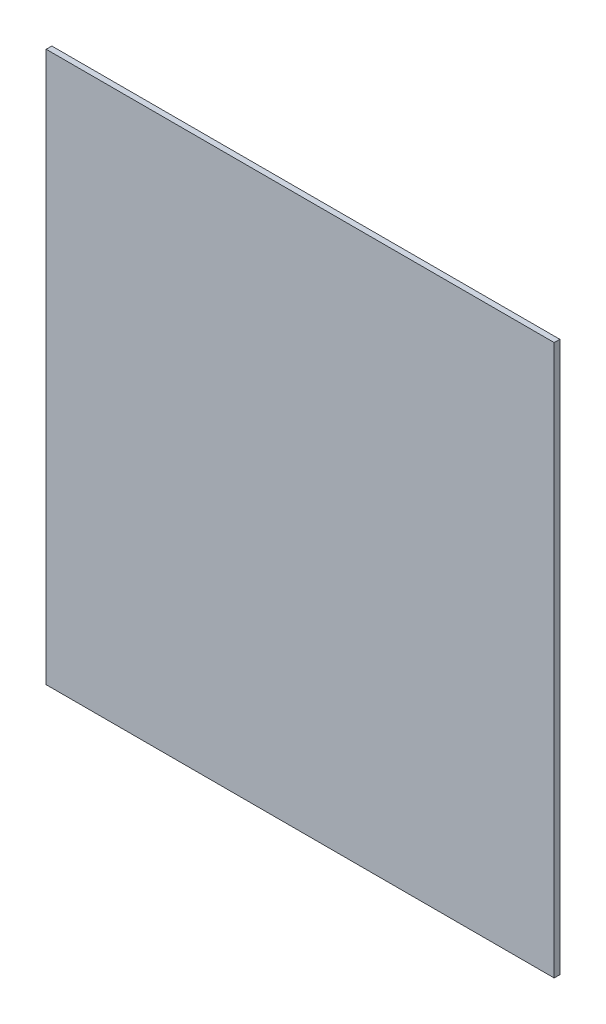
ISO-10303-21;
HEADER;
FILE_DESCRIPTION(('STEP AP214'),'2;1');
FILE_NAME('part.step','',(''),(''),'','','');
FILE_SCHEMA(('AUTOMOTIVE_DESIGN { 1 0 10303 214 1 1 1 1 }'));
ENDSEC;
DATA;
#1=APPLICATION_CONTEXT('core data for automotive mechanical design processes');
#2=APPLICATION_PROTOCOL_DEFINITION('international standard','automotive_design',2000,#1);
#3=PRODUCT_CONTEXT('',#1,'mechanical');
#4=PRODUCT('Part','Part','',(#3));
#5=PRODUCT_RELATED_PRODUCT_CATEGORY('part','',(#4));
#6=PRODUCT_DEFINITION_FORMATION('','',#4);
#7=PRODUCT_DEFINITION_CONTEXT('part definition',#1,'design');
#8=PRODUCT_DEFINITION('design','',#6,#7);
#9=PRODUCT_DEFINITION_SHAPE('','',#8);
#10=(LENGTH_UNIT() NAMED_UNIT(*) SI_UNIT(.MILLI.,.METRE.));
#11=(NAMED_UNIT(*) PLANE_ANGLE_UNIT() SI_UNIT($,.RADIAN.));
#12=(NAMED_UNIT(*) SI_UNIT($,.STERADIAN.) SOLID_ANGLE_UNIT());
#13=UNCERTAINTY_MEASURE_WITH_UNIT(LENGTH_MEASURE(1.E-05),#10,'distance_accuracy_value','');
#14=(GEOMETRIC_REPRESENTATION_CONTEXT(3) GLOBAL_UNCERTAINTY_ASSIGNED_CONTEXT((#13)) GLOBAL_UNIT_ASSIGNED_CONTEXT((#10,
#11,#12)) REPRESENTATION_CONTEXT('',''));
#15=CARTESIAN_POINT('',(0.,0.,0.));
#16=DIRECTION('',(0.,0.,1.));
#17=DIRECTION('',(1.,0.,0.));
#18=AXIS2_PLACEMENT_3D('',#15,#16,#17);
#19=CARTESIAN_POINT('',(0.,0.,2.));
#20=DIRECTION('',(1.,0.,0.));
#21=DIRECTION('',(0.,1.,0.));
#22=AXIS2_PLACEMENT_3D('',#19,#20,#21);
#23=PLANE('',#22);
#24=DIRECTION('',(0.,-1.,0.));
#25=VECTOR('',#24,1.);
#26=CARTESIAN_POINT('',(0.,0.,0.));
#27=LINE('',#26,#25);
#28=CARTESIAN_POINT('',(0.,0.,0.));
#29=VERTEX_POINT('',#28);
#30=CARTESIAN_POINT('',(0.,-195.,0.));
#31=VERTEX_POINT('',#30);
#32=EDGE_CURVE('E107',#29,#31,#27,.T.);
#33=ORIENTED_EDGE('',*,*,#32,.T.);
#34=DIRECTION('',(0.,0.,-1.));
#35=VECTOR('',#34,1.);
#36=CARTESIAN_POINT('',(0.,-195.,2.));
#37=LINE('',#36,#35);
#38=CARTESIAN_POINT('',(0.,-195.,2.));
#39=VERTEX_POINT('',#38);
#40=EDGE_CURVE('E11',#39,#31,#37,.T.);
#41=ORIENTED_EDGE('',*,*,#40,.F.);
#42=DIRECTION('',(0.,-1.,0.));
#43=VECTOR('',#42,1.);
#44=CARTESIAN_POINT('',(0.,0.,2.));
#45=LINE('',#44,#43);
#46=CARTESIAN_POINT('',(0.,0.,2.));
#47=VERTEX_POINT('',#46);
#48=EDGE_CURVE('E91',#47,#39,#45,.T.);
#49=ORIENTED_EDGE('',*,*,#48,.F.);
#50=DIRECTION('',(0.,0.,-1.));
#51=VECTOR('',#50,1.);
#52=CARTESIAN_POINT('',(0.,0.,2.));
#53=LINE('',#52,#51);
#54=EDGE_CURVE('E103',#47,#29,#53,.T.);
#55=ORIENTED_EDGE('',*,*,#54,.T.);
#56=EDGE_LOOP('',(#33,#41,#49,#55));
#57=FACE_BOUND('',#56,.T.);
#58=ADVANCED_FACE('F39',(#57),#23,.F.);
#59=CARTESIAN_POINT('',(0.,-195.,2.));
#60=DIRECTION('',(0.,1.,0.));
#61=DIRECTION('',(0.,0.,1.));
#62=AXIS2_PLACEMENT_3D('',#59,#60,#61);
#63=PLANE('',#62);
#64=DIRECTION('',(1.,0.,0.));
#65=VECTOR('',#64,1.);
#66=CARTESIAN_POINT('',(0.,-195.,0.));
#67=LINE('',#66,#65);
#68=CARTESIAN_POINT('',(180.,-195.,0.));
#69=VERTEX_POINT('',#68);
#70=EDGE_CURVE('E96',#31,#69,#67,.T.);
#71=ORIENTED_EDGE('',*,*,#70,.T.);
#72=DIRECTION('',(0.,0.,-1.));
#73=VECTOR('',#72,1.);
#74=CARTESIAN_POINT('',(180.,-195.,2.));
#75=LINE('',#74,#73);
#76=CARTESIAN_POINT('',(180.,-195.,2.));
#77=VERTEX_POINT('',#76);
#78=EDGE_CURVE('E48',#77,#69,#75,.T.);
#79=ORIENTED_EDGE('',*,*,#78,.F.);
#80=DIRECTION('',(1.,0.,0.));
#81=VECTOR('',#80,1.);
#82=CARTESIAN_POINT('',(0.,-195.,2.));
#83=LINE('',#82,#81);
#84=EDGE_CURVE('E86',#39,#77,#83,.T.);
#85=ORIENTED_EDGE('',*,*,#84,.F.);
#86=ORIENTED_EDGE('',*,*,#40,.T.);
#87=EDGE_LOOP('',(#71,#79,#85,#86));
#88=FACE_BOUND('',#87,.T.);
#89=ADVANCED_FACE('F95',(#88),#63,.F.);
#90=CARTESIAN_POINT('',(180.,0.,2.));
#91=DIRECTION('',(-1.,0.,0.));
#92=DIRECTION('',(0.,-1.,0.));
#93=AXIS2_PLACEMENT_3D('',#90,#91,#92);
#94=PLANE('',#93);
#95=DIRECTION('',(0.,1.,0.));
#96=VECTOR('',#95,1.);
#97=CARTESIAN_POINT('',(180.,0.,0.));
#98=LINE('',#97,#96);
#99=CARTESIAN_POINT('',(180.,0.,0.));
#100=VERTEX_POINT('',#99);
#101=EDGE_CURVE('E73',#69,#100,#98,.T.);
#102=ORIENTED_EDGE('',*,*,#101,.T.);
#103=DIRECTION('',(0.,0.,-1.));
#104=VECTOR('',#103,1.);
#105=CARTESIAN_POINT('',(180.,0.,2.));
#106=LINE('',#105,#104);
#107=CARTESIAN_POINT('',(180.,0.,2.));
#108=VERTEX_POINT('',#107);
#109=EDGE_CURVE('E98',#108,#100,#106,.T.);
#110=ORIENTED_EDGE('',*,*,#109,.F.);
#111=DIRECTION('',(0.,1.,0.));
#112=VECTOR('',#111,1.);
#113=CARTESIAN_POINT('',(180.,0.,2.));
#114=LINE('',#113,#112);
#115=EDGE_CURVE('E89',#77,#108,#114,.T.);
#116=ORIENTED_EDGE('',*,*,#115,.F.);
#117=ORIENTED_EDGE('',*,*,#78,.T.);
#118=EDGE_LOOP('',(#102,#110,#116,#117));
#119=FACE_BOUND('',#118,.T.);
#120=ADVANCED_FACE('F99',(#119),#94,.F.);
#121=CARTESIAN_POINT('',(0.,0.,2.));
#122=DIRECTION('',(0.,-1.,0.));
#123=DIRECTION('',(0.,0.,-1.));
#124=AXIS2_PLACEMENT_3D('',#121,#122,#123);
#125=PLANE('',#124);
#126=DIRECTION('',(-1.,0.,0.));
#127=VECTOR('',#126,1.);
#128=CARTESIAN_POINT('',(0.,0.,0.));
#129=LINE('',#128,#127);
#130=EDGE_CURVE('E79',#100,#29,#129,.T.);
#131=ORIENTED_EDGE('',*,*,#130,.T.);
#132=ORIENTED_EDGE('',*,*,#54,.F.);
#133=DIRECTION('',(-1.,0.,0.));
#134=VECTOR('',#133,1.);
#135=CARTESIAN_POINT('',(0.,0.,2.));
#136=LINE('',#135,#134);
#137=EDGE_CURVE('E56',#108,#47,#136,.T.);
#138=ORIENTED_EDGE('',*,*,#137,.F.);
#139=ORIENTED_EDGE('',*,*,#109,.T.);
#140=EDGE_LOOP('',(#131,#132,#138,#139));
#141=FACE_BOUND('',#140,.T.);
#142=ADVANCED_FACE('F120',(#141),#125,.F.);
#143=CARTESIAN_POINT('',(0.,0.,2.));
#144=DIRECTION('',(0.,0.,1.));
#145=DIRECTION('',(1.,0.,0.));
#146=AXIS2_PLACEMENT_3D('',#143,#144,#145);
#147=PLANE('',#146);
#148=ORIENTED_EDGE('',*,*,#48,.T.);
#149=ORIENTED_EDGE('',*,*,#84,.T.);
#150=ORIENTED_EDGE('',*,*,#115,.T.);
#151=ORIENTED_EDGE('',*,*,#137,.T.);
#152=EDGE_LOOP('',(#148,#149,#150,#151));
#153=FACE_BOUND('',#152,.T.);
#154=ADVANCED_FACE('F87',(#153),#147,.T.);
#155=CARTESIAN_POINT('',(0.,0.,0.));
#156=DIRECTION('',(0.,0.,1.));
#157=DIRECTION('',(1.,0.,0.));
#158=AXIS2_PLACEMENT_3D('',#155,#156,#157);
#159=PLANE('',#158);
#160=ORIENTED_EDGE('',*,*,#32,.F.);
#161=ORIENTED_EDGE('',*,*,#130,.F.);
#162=ORIENTED_EDGE('',*,*,#101,.F.);
#163=ORIENTED_EDGE('',*,*,#70,.F.);
#164=EDGE_LOOP('',(#160,#161,#162,#163));
#165=FACE_BOUND('',#164,.T.);
#166=ADVANCED_FACE('F123',(#165),#159,.F.);
#167=CLOSED_SHELL('',(#58,#89,#120,#142,#154,#166));
#168=MANIFOLD_SOLID_BREP('B2',#167);
#169=ADVANCED_BREP_SHAPE_REPRESENTATION('',(#18,#168),#14);
#170=SHAPE_DEFINITION_REPRESENTATION(#9,#169);
ENDSEC;
END-ISO-10303-21;
